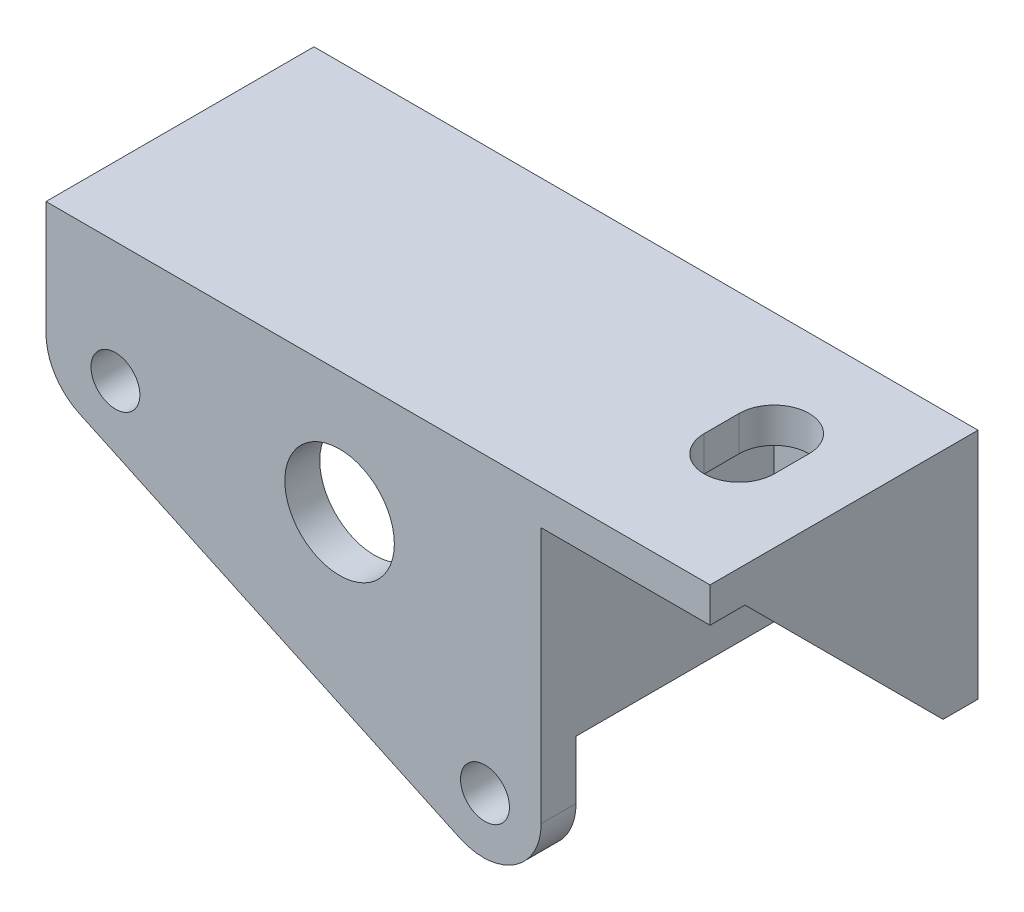
ISO-10303-21;
HEADER;
FILE_DESCRIPTION(('STEP AP214'),'2;1');
FILE_NAME('part.step','',(''),(''),'','','');
FILE_SCHEMA(('AUTOMOTIVE_DESIGN { 1 0 10303 214 1 1 1 1 }'));
ENDSEC;
DATA;
#1=APPLICATION_CONTEXT('core data for automotive mechanical design processes');
#2=APPLICATION_PROTOCOL_DEFINITION('international standard','automotive_design',2000,#1);
#3=PRODUCT_CONTEXT('',#1,'mechanical');
#4=PRODUCT('Part','Part','',(#3));
#5=PRODUCT_RELATED_PRODUCT_CATEGORY('part','',(#4));
#6=PRODUCT_DEFINITION_FORMATION('','',#4);
#7=PRODUCT_DEFINITION_CONTEXT('part definition',#1,'design');
#8=PRODUCT_DEFINITION('design','',#6,#7);
#9=PRODUCT_DEFINITION_SHAPE('','',#8);
#10=(LENGTH_UNIT() NAMED_UNIT(*) SI_UNIT(.MILLI.,.METRE.));
#11=(NAMED_UNIT(*) PLANE_ANGLE_UNIT() SI_UNIT($,.RADIAN.));
#12=(NAMED_UNIT(*) SI_UNIT($,.STERADIAN.) SOLID_ANGLE_UNIT());
#13=UNCERTAINTY_MEASURE_WITH_UNIT(LENGTH_MEASURE(1.E-05),#10,'distance_accuracy_value','');
#14=(GEOMETRIC_REPRESENTATION_CONTEXT(3) GLOBAL_UNCERTAINTY_ASSIGNED_CONTEXT((#13)) GLOBAL_UNIT_ASSIGNED_CONTEXT((#10,
#11,#12)) REPRESENTATION_CONTEXT('',''));
#15=CARTESIAN_POINT('',(0.,0.,0.));
#16=DIRECTION('',(0.,0.,1.));
#17=DIRECTION('',(1.,0.,0.));
#18=AXIS2_PLACEMENT_3D('',#15,#16,#17);
#19=CARTESIAN_POINT('',(-48.5,0.,20.));
#20=DIRECTION('',(0.,0.,-1.));
#21=DIRECTION('',(-1.,0.,0.));
#22=AXIS2_PLACEMENT_3D('',#19,#20,#21);
#23=PLANE('',#22);
#24=CARTESIAN_POINT('',(-42.5413323663169,-10.3546427164349,20.));
#25=DIRECTION('',(0.,0.,-1.));
#26=DIRECTION('',(-1.,0.,0.));
#27=AXIS2_PLACEMENT_3D('',#24,#25,#26);
#28=CIRCLE('',#27,2.09999999945802);
#29=CARTESIAN_POINT('',(-44.6413323657749,-10.3546427164349,20.));
#30=VERTEX_POINT('',#29);
#31=EDGE_CURVE('E387',#30,#30,#28,.T.);
#32=ORIENTED_EDGE('',*,*,#31,.F.);
#33=EDGE_LOOP('',(#32));
#34=FACE_BOUND('',#33,.T.);
#35=CARTESIAN_POINT('',(-10.8205598200341,-25.1462818773592,20.));
#36=DIRECTION('',(0.,0.,-1.));
#37=DIRECTION('',(-1.,0.,0.));
#38=AXIS2_PLACEMENT_3D('',#35,#36,#37);
#39=CIRCLE('',#38,2.09999999945802);
#40=CARTESIAN_POINT('',(-12.9205598194921,-25.1462818773592,20.));
#41=VERTEX_POINT('',#40);
#42=EDGE_CURVE('E390',#41,#41,#39,.T.);
#43=ORIENTED_EDGE('',*,*,#42,.F.);
#44=EDGE_LOOP('',(#43));
#45=FACE_BOUND('',#44,.T.);
#46=CARTESIAN_POINT('',(-23.3000000000015,-10.4999999999994,20.));
#47=DIRECTION('',(0.,0.,-1.));
#48=DIRECTION('',(-1.,0.,0.));
#49=AXIS2_PLACEMENT_3D('',#46,#47,#48);
#50=CIRCLE('',#49,4.7);
#51=CARTESIAN_POINT('',(-28.0000000000015,-10.4999999999994,20.));
#52=VERTEX_POINT('',#51);
#53=EDGE_CURVE('E395',#52,#52,#50,.T.);
#54=ORIENTED_EDGE('',*,*,#53,.F.);
#55=EDGE_LOOP('',(#54));
#56=FACE_BOUND('',#55,.T.);
#57=CARTESIAN_POINT('',(-11.,-25.,20.));
#58=DIRECTION('',(0.,0.,-1.));
#59=DIRECTION('',(-1.,0.,0.));
#60=AXIS2_PLACEMENT_3D('',#57,#58,#59);
#61=CIRCLE('',#60,5.);
#62=CARTESIAN_POINT('',(-6.,-25.,20.));
#63=VERTEX_POINT('',#62);
#64=CARTESIAN_POINT('',(-10.9674545190611,-29.9998940780451,20.));
#65=VERTEX_POINT('',#64);
#66=EDGE_CURVE('E51',#63,#65,#61,.T.);
#67=ORIENTED_EDGE('',*,*,#66,.T.);
#68=CARTESIAN_POINT('',(-10.9349090381221,-25.,20.));
#69=DIRECTION('',(0.,0.,-1.));
#70=DIRECTION('',(-1.,0.,0.));
#71=AXIS2_PLACEMENT_3D('',#68,#69,#70);
#72=CIRCLE('',#71,5.);
#73=CARTESIAN_POINT('',(-13.0480003468256,-29.5315389351833,20.));
#74=VERTEX_POINT('',#73);
#75=EDGE_CURVE('E367',#65,#74,#72,.T.);
#76=ORIENTED_EDGE('',*,*,#75,.T.);
#77=DIRECTION('',(0.906307787036653,-0.422618261740693,0.));
#78=VECTOR('',#77,1.);
#79=CARTESIAN_POINT('',(-53.4792888802733,-10.6781194629626,20.));
#80=LINE('',#79,#78);
#81=CARTESIAN_POINT('',(-45.6130913087035,-14.3461876311458,20.));
#82=VERTEX_POINT('',#81);
#83=EDGE_CURVE('E372',#82,#74,#80,.T.);
#84=ORIENTED_EDGE('',*,*,#83,.F.);
#85=CARTESIAN_POINT('',(-43.5,-9.81464869596251,20.));
#86=DIRECTION('',(0.,0.,-1.));
#87=DIRECTION('',(-1.,0.,0.));
#88=AXIS2_PLACEMENT_3D('',#85,#86,#87);
#89=CIRCLE('',#88,5.);
#90=CARTESIAN_POINT('',(-48.5,-9.81464869596251,20.));
#91=VERTEX_POINT('',#90);
#92=EDGE_CURVE('E364',#82,#91,#89,.T.);
#93=ORIENTED_EDGE('',*,*,#92,.T.);
#94=DIRECTION('',(0.,1.,0.));
#95=VECTOR('',#94,1.);
#96=CARTESIAN_POINT('',(-48.5,0.,20.));
#97=LINE('',#96,#95);
#98=CARTESIAN_POINT('',(-48.5,-3.,20.));
#99=VERTEX_POINT('',#98);
#100=EDGE_CURVE('E226',#91,#99,#97,.T.);
#101=ORIENTED_EDGE('',*,*,#100,.T.);
#102=DIRECTION('',(1.,0.,0.));
#103=VECTOR('',#102,1.);
#104=CARTESIAN_POINT('',(-48.5,-3.,20.));
#105=LINE('',#104,#103);
#106=CARTESIAN_POINT('',(-8.5,-3.,20.));
#107=VERTEX_POINT('',#106);
#108=EDGE_CURVE('E244',#99,#107,#105,.T.);
#109=ORIENTED_EDGE('',*,*,#108,.T.);
#110=DIRECTION('',(0.,1.,0.));
#111=VECTOR('',#110,1.);
#112=CARTESIAN_POINT('',(-8.5,-3.,20.));
#113=LINE('',#112,#111);
#114=CARTESIAN_POINT('',(-8.5,-20.,20.));
#115=VERTEX_POINT('',#114);
#116=EDGE_CURVE('E206',#115,#107,#113,.T.);
#117=ORIENTED_EDGE('',*,*,#116,.F.);
#118=DIRECTION('',(-1.,0.,0.));
#119=VECTOR('',#118,1.);
#120=CARTESIAN_POINT('',(-8.5,-20.,20.));
#121=LINE('',#120,#119);
#122=CARTESIAN_POINT('',(-6.,-20.,20.));
#123=VERTEX_POINT('',#122);
#124=EDGE_CURVE('E223',#123,#115,#121,.T.);
#125=ORIENTED_EDGE('',*,*,#124,.F.);
#126=DIRECTION('',(0.,1.,0.));
#127=VECTOR('',#126,1.);
#128=CARTESIAN_POINT('',(-6.,-3.,20.));
#129=LINE('',#128,#127);
#130=EDGE_CURVE('E216',#63,#123,#129,.T.);
#131=ORIENTED_EDGE('',*,*,#130,.F.);
#132=EDGE_LOOP('',(#67,#76,#84,#93,#101,#109,#117,#125,#131));
#133=FACE_BOUND('',#132,.T.);
#134=ADVANCED_FACE('F35',(#34,#45,#56,#133),#23,.T.);
#135=CARTESIAN_POINT('',(8.5,0.,0.));
#136=DIRECTION('',(0.,-1.,0.));
#137=DIRECTION('',(0.,0.,-1.));
#138=AXIS2_PLACEMENT_3D('',#135,#136,#137);
#139=PLANE('',#138);
#140=DIRECTION('',(-1.,0.,0.));
#141=VECTOR('',#140,1.);
#142=CARTESIAN_POINT('',(8.5,0.,0.));
#143=LINE('',#142,#141);
#144=CARTESIAN_POINT('',(8.5,0.,0.));
#145=VERTEX_POINT('',#144);
#146=CARTESIAN_POINT('',(-48.5,0.,0.));
#147=VERTEX_POINT('',#146);
#148=EDGE_CURVE('E349',#145,#147,#143,.T.);
#149=ORIENTED_EDGE('',*,*,#148,.T.);
#150=DIRECTION('',(0.,0.,-1.));
#151=VECTOR('',#150,1.);
#152=CARTESIAN_POINT('',(-48.5,0.,20.));
#153=LINE('',#152,#151);
#154=CARTESIAN_POINT('',(-48.5,0.,23.));
#155=VERTEX_POINT('',#154);
#156=EDGE_CURVE('E236',#155,#147,#153,.T.);
#157=ORIENTED_EDGE('',*,*,#156,.F.);
#158=DIRECTION('',(1.,0.,0.));
#159=VECTOR('',#158,1.);
#160=CARTESIAN_POINT('',(-48.5,0.,23.));
#161=LINE('',#160,#159);
#162=CARTESIAN_POINT('',(8.5,0.,23.));
#163=VERTEX_POINT('',#162);
#164=EDGE_CURVE('E233',#155,#163,#161,.T.);
#165=ORIENTED_EDGE('',*,*,#164,.T.);
#166=DIRECTION('',(0.,0.,1.));
#167=VECTOR('',#166,1.);
#168=CARTESIAN_POINT('',(8.5,0.,0.));
#169=LINE('',#168,#167);
#170=EDGE_CURVE('E220',#145,#163,#169,.T.);
#171=ORIENTED_EDGE('',*,*,#170,.F.);
#172=EDGE_LOOP('',(#149,#157,#165,#171));
#173=FACE_BOUND('',#172,.T.);
#174=CARTESIAN_POINT('',(0.,0.,9.00000000000001));
#175=DIRECTION('',(0.,-1.,0.));
#176=DIRECTION('',(0.,0.,-1.));
#177=AXIS2_PLACEMENT_3D('',#174,#175,#176);
#178=CIRCLE('',#177,3.);
#179=CARTESIAN_POINT('',(-3.,0.,9.));
#180=VERTEX_POINT('',#179);
#181=CARTESIAN_POINT('',(3.,0.,9.));
#182=VERTEX_POINT('',#181);
#183=EDGE_CURVE('E258',#180,#182,#178,.T.);
#184=ORIENTED_EDGE('',*,*,#183,.T.);
#185=DIRECTION('',(0.,0.,1.));
#186=VECTOR('',#185,1.);
#187=CARTESIAN_POINT('',(3.,0.,9.00000000000001));
#188=LINE('',#187,#186);
#189=CARTESIAN_POINT('',(3.,0.,12.));
#190=VERTEX_POINT('',#189);
#191=EDGE_CURVE('E276',#182,#190,#188,.T.);
#192=ORIENTED_EDGE('',*,*,#191,.T.);
#193=CARTESIAN_POINT('',(0.,0.,12.));
#194=DIRECTION('',(0.,-1.,0.));
#195=DIRECTION('',(0.,0.,-1.));
#196=AXIS2_PLACEMENT_3D('',#193,#194,#195);
#197=CIRCLE('',#196,3.);
#198=CARTESIAN_POINT('',(-3.,0.,12.));
#199=VERTEX_POINT('',#198);
#200=EDGE_CURVE('E252',#190,#199,#197,.T.);
#201=ORIENTED_EDGE('',*,*,#200,.T.);
#202=DIRECTION('',(0.,0.,-1.));
#203=VECTOR('',#202,1.);
#204=CARTESIAN_POINT('',(-3.,0.,9.00000000000001));
#205=LINE('',#204,#203);
#206=EDGE_CURVE('E255',#199,#180,#205,.T.);
#207=ORIENTED_EDGE('',*,*,#206,.T.);
#208=EDGE_LOOP('',(#184,#192,#201,#207));
#209=FACE_BOUND('',#208,.T.);
#210=ADVANCED_FACE('F443',(#173,#209),#139,.F.);
#211=CARTESIAN_POINT('',(-6.,-3.,2.99999999999999));
#212=DIRECTION('',(0.,1.,0.));
#213=DIRECTION('',(0.,0.,1.));
#214=AXIS2_PLACEMENT_3D('',#211,#212,#213);
#215=PLANE('',#214);
#216=DIRECTION('',(0.,0.,1.));
#217=VECTOR('',#216,1.);
#218=CARTESIAN_POINT('',(6.,-3.,2.99999999999999));
#219=LINE('',#218,#217);
#220=CARTESIAN_POINT('',(6.,-3.,2.99999999999999));
#221=VERTEX_POINT('',#220);
#222=CARTESIAN_POINT('',(6.,-3.,20.));
#223=VERTEX_POINT('',#222);
#224=EDGE_CURVE('E321',#221,#223,#219,.T.);
#225=ORIENTED_EDGE('',*,*,#224,.T.);
#226=DIRECTION('',(-1.,0.,0.));
#227=VECTOR('',#226,1.);
#228=CARTESIAN_POINT('',(8.5,-3.,20.));
#229=LINE('',#228,#227);
#230=CARTESIAN_POINT('',(8.5,-3.,20.));
#231=VERTEX_POINT('',#230);
#232=EDGE_CURVE('E202',#231,#223,#229,.T.);
#233=ORIENTED_EDGE('',*,*,#232,.F.);
#234=DIRECTION('',(0.,0.,-1.));
#235=VECTOR('',#234,1.);
#236=CARTESIAN_POINT('',(8.5,-3.,23.));
#237=LINE('',#236,#235);
#238=CARTESIAN_POINT('',(8.5,-3.,23.));
#239=VERTEX_POINT('',#238);
#240=EDGE_CURVE('E194',#239,#231,#237,.T.);
#241=ORIENTED_EDGE('',*,*,#240,.F.);
#242=DIRECTION('',(1.,0.,0.));
#243=VECTOR('',#242,1.);
#244=CARTESIAN_POINT('',(8.5,-3.,23.));
#245=LINE('',#244,#243);
#246=CARTESIAN_POINT('',(-6.,-3.,23.));
#247=VERTEX_POINT('',#246);
#248=EDGE_CURVE('E200',#247,#239,#245,.T.);
#249=ORIENTED_EDGE('',*,*,#248,.F.);
#250=DIRECTION('',(0.,0.,1.));
#251=VECTOR('',#250,1.);
#252=CARTESIAN_POINT('',(-6.,-3.,2.99999999999999));
#253=LINE('',#252,#251);
#254=CARTESIAN_POINT('',(-6.,-3.,2.99999999999999));
#255=VERTEX_POINT('',#254);
#256=EDGE_CURVE('E320',#255,#247,#253,.T.);
#257=ORIENTED_EDGE('',*,*,#256,.F.);
#258=DIRECTION('',(1.,0.,0.));
#259=VECTOR('',#258,1.);
#260=CARTESIAN_POINT('',(-6.,-3.,2.99999999999999));
#261=LINE('',#260,#259);
#262=EDGE_CURVE('E323',#255,#221,#261,.T.);
#263=ORIENTED_EDGE('',*,*,#262,.T.);
#264=EDGE_LOOP('',(#225,#233,#241,#249,#257,#263));
#265=FACE_BOUND('',#264,.T.);
#266=CARTESIAN_POINT('',(0.,-3.,9.));
#267=DIRECTION('',(0.,1.,0.));
#268=DIRECTION('',(-1.,0.,0.));
#269=AXIS2_PLACEMENT_3D('',#266,#267,#268);
#270=CIRCLE('',#269,3.);
#271=CARTESIAN_POINT('',(3.,-3.,9.));
#272=VERTEX_POINT('',#271);
#273=CARTESIAN_POINT('',(-3.,-3.,9.));
#274=VERTEX_POINT('',#273);
#275=EDGE_CURVE('E261',#272,#274,#270,.T.);
#276=ORIENTED_EDGE('',*,*,#275,.T.);
#277=DIRECTION('',(0.,0.,1.));
#278=VECTOR('',#277,1.);
#279=CARTESIAN_POINT('',(-3.,-3.,9.));
#280=LINE('',#279,#278);
#281=CARTESIAN_POINT('',(-3.,-3.,12.));
#282=VERTEX_POINT('',#281);
#283=EDGE_CURVE('E270',#274,#282,#280,.T.);
#284=ORIENTED_EDGE('',*,*,#283,.T.);
#285=CARTESIAN_POINT('',(0.,-3.,12.));
#286=DIRECTION('',(0.,1.,0.));
#287=DIRECTION('',(1.,0.,0.));
#288=AXIS2_PLACEMENT_3D('',#285,#286,#287);
#289=CIRCLE('',#288,3.);
#290=CARTESIAN_POINT('',(3.,-3.,12.));
#291=VERTEX_POINT('',#290);
#292=EDGE_CURVE('E267',#282,#291,#289,.T.);
#293=ORIENTED_EDGE('',*,*,#292,.T.);
#294=DIRECTION('',(0.,0.,-1.));
#295=VECTOR('',#294,1.);
#296=CARTESIAN_POINT('',(3.,-3.,9.));
#297=LINE('',#296,#295);
#298=EDGE_CURVE('E264',#291,#272,#297,.T.);
#299=ORIENTED_EDGE('',*,*,#298,.T.);
#300=EDGE_LOOP('',(#276,#284,#293,#299));
#301=FACE_BOUND('',#300,.T.);
#302=ADVANCED_FACE('F197',(#265,#301),#215,.F.);
#303=CARTESIAN_POINT('',(8.5,-20.,2.99999999999999));
#304=DIRECTION('',(0.,0.707106781186548,-0.707106781186547));
#305=DIRECTION('',(0.,0.707106781186547,0.707106781186548));
#306=AXIS2_PLACEMENT_3D('',#303,#304,#305);
#307=PLANE('',#306);
#308=DIRECTION('',(0.,0.707106781186547,0.707106781186548));
#309=VECTOR('',#308,1.);
#310=CARTESIAN_POINT('',(6.,-20.,2.99999999999999));
#311=LINE('',#310,#309);
#312=CARTESIAN_POINT('',(6.,-20.,2.99999999999999));
#313=VERTEX_POINT('',#312);
#314=EDGE_CURVE('E351',#313,#223,#311,.T.);
#315=ORIENTED_EDGE('',*,*,#314,.F.);
#316=DIRECTION('',(-1.,0.,0.));
#317=VECTOR('',#316,1.);
#318=CARTESIAN_POINT('',(8.5,-20.,2.99999999999999));
#319=LINE('',#318,#317);
#320=CARTESIAN_POINT('',(8.5,-20.,2.99999999999999));
#321=VERTEX_POINT('',#320);
#322=EDGE_CURVE('E345',#321,#313,#319,.T.);
#323=ORIENTED_EDGE('',*,*,#322,.F.);
#324=DIRECTION('',(0.,-0.707106781186548,-0.707106781186548));
#325=VECTOR('',#324,1.);
#326=CARTESIAN_POINT('',(8.5,-3.,20.));
#327=LINE('',#326,#325);
#328=EDGE_CURVE('E335',#231,#321,#327,.T.);
#329=ORIENTED_EDGE('',*,*,#328,.F.);
#330=ORIENTED_EDGE('',*,*,#232,.T.);
#331=EDGE_LOOP('',(#315,#323,#329,#330));
#332=FACE_BOUND('',#331,.T.);
#333=ADVANCED_FACE('F424',(#332),#307,.F.);
#334=CARTESIAN_POINT('',(8.5,0.,0.));
#335=DIRECTION('',(0.,0.,1.));
#336=DIRECTION('',(0.,-1.,0.));
#337=AXIS2_PLACEMENT_3D('',#334,#335,#336);
#338=PLANE('',#337);
#339=DIRECTION('',(0.,-1.,0.));
#340=VECTOR('',#339,1.);
#341=CARTESIAN_POINT('',(3.,-9.00000000000001,0.));
#342=LINE('',#341,#340);
#343=CARTESIAN_POINT('',(3.,-9.00000000000001,0.));
#344=VERTEX_POINT('',#343);
#345=CARTESIAN_POINT('',(3.,-12.,0.));
#346=VERTEX_POINT('',#345);
#347=EDGE_CURVE('E287',#344,#346,#342,.T.);
#348=ORIENTED_EDGE('',*,*,#347,.F.);
#349=CARTESIAN_POINT('',(0.,-9.00000000000001,0.));
#350=DIRECTION('',(0.,0.,1.));
#351=DIRECTION('',(0.,-1.,0.));
#352=AXIS2_PLACEMENT_3D('',#349,#350,#351);
#353=CIRCLE('',#352,3.);
#354=CARTESIAN_POINT('',(-3.,-9.00000000000001,0.));
#355=VERTEX_POINT('',#354);
#356=EDGE_CURVE('E290',#355,#344,#353,.F.);
#357=ORIENTED_EDGE('',*,*,#356,.F.);
#358=DIRECTION('',(0.,1.,0.));
#359=VECTOR('',#358,1.);
#360=CARTESIAN_POINT('',(-3.,-9.00000000000001,0.));
#361=LINE('',#360,#359);
#362=CARTESIAN_POINT('',(-3.,-12.,0.));
#363=VERTEX_POINT('',#362);
#364=EDGE_CURVE('E307',#363,#355,#361,.T.);
#365=ORIENTED_EDGE('',*,*,#364,.F.);
#366=CARTESIAN_POINT('',(0.,-12.,0.));
#367=DIRECTION('',(0.,0.,1.));
#368=DIRECTION('',(0.,-1.,0.));
#369=AXIS2_PLACEMENT_3D('',#366,#367,#368);
#370=CIRCLE('',#369,3.);
#371=EDGE_CURVE('E285',#346,#363,#370,.F.);
#372=ORIENTED_EDGE('',*,*,#371,.F.);
#373=EDGE_LOOP('',(#348,#357,#365,#372));
#374=FACE_BOUND('',#373,.T.);
#375=DIRECTION('',(0.,1.,0.));
#376=VECTOR('',#375,1.);
#377=CARTESIAN_POINT('',(-8.5,0.,0.));
#378=LINE('',#377,#376);
#379=CARTESIAN_POINT('',(-8.5,-20.,0.));
#380=VERTEX_POINT('',#379);
#381=CARTESIAN_POINT('',(-8.5,-3.,0.));
#382=VERTEX_POINT('',#381);
#383=EDGE_CURVE('E329',#380,#382,#378,.T.);
#384=ORIENTED_EDGE('',*,*,#383,.T.);
#385=DIRECTION('',(1.,0.,0.));
#386=VECTOR('',#385,1.);
#387=CARTESIAN_POINT('',(-48.5,-3.,0.));
#388=LINE('',#387,#386);
#389=CARTESIAN_POINT('',(-48.5,-3.,0.));
#390=VERTEX_POINT('',#389);
#391=EDGE_CURVE('E249',#390,#382,#388,.T.);
#392=ORIENTED_EDGE('',*,*,#391,.F.);
#393=DIRECTION('',(0.,-1.,0.));
#394=VECTOR('',#393,1.);
#395=CARTESIAN_POINT('',(-48.5,0.,0.));
#396=LINE('',#395,#394);
#397=EDGE_CURVE('E239',#147,#390,#396,.T.);
#398=ORIENTED_EDGE('',*,*,#397,.F.);
#399=ORIENTED_EDGE('',*,*,#148,.F.);
#400=DIRECTION('',(0.,1.,0.));
#401=VECTOR('',#400,1.);
#402=CARTESIAN_POINT('',(8.5,0.,0.));
#403=LINE('',#402,#401);
#404=CARTESIAN_POINT('',(8.5,-20.,0.));
#405=VERTEX_POINT('',#404);
#406=EDGE_CURVE('E331',#405,#145,#403,.T.);
#407=ORIENTED_EDGE('',*,*,#406,.F.);
#408=DIRECTION('',(-1.,0.,0.));
#409=VECTOR('',#408,1.);
#410=CARTESIAN_POINT('',(8.5,-20.,0.));
#411=LINE('',#410,#409);
#412=EDGE_CURVE('E339',#405,#380,#411,.T.);
#413=ORIENTED_EDGE('',*,*,#412,.T.);
#414=EDGE_LOOP('',(#384,#392,#398,#399,#407,#413));
#415=FACE_BOUND('',#414,.T.);
#416=ADVANCED_FACE('F417',(#374,#415),#338,.F.);
#417=CARTESIAN_POINT('',(8.5,-20.,0.));
#418=DIRECTION('',(0.,1.,0.));
#419=DIRECTION('',(0.,0.,1.));
#420=AXIS2_PLACEMENT_3D('',#417,#418,#419);
#421=PLANE('',#420);
#422=DIRECTION('',(0.,0.,-1.));
#423=VECTOR('',#422,1.);
#424=CARTESIAN_POINT('',(-8.5,-20.,0.));
#425=LINE('',#424,#423);
#426=EDGE_CURVE('E333',#115,#380,#425,.T.);
#427=ORIENTED_EDGE('',*,*,#426,.T.);
#428=ORIENTED_EDGE('',*,*,#412,.F.);
#429=DIRECTION('',(0.,0.,-1.));
#430=VECTOR('',#429,1.);
#431=CARTESIAN_POINT('',(8.5,-20.,0.));
#432=LINE('',#431,#430);
#433=EDGE_CURVE('E337',#321,#405,#432,.T.);
#434=ORIENTED_EDGE('',*,*,#433,.F.);
#435=ORIENTED_EDGE('',*,*,#322,.T.);
#436=DIRECTION('',(1.,0.,0.));
#437=VECTOR('',#436,1.);
#438=CARTESIAN_POINT('',(-6.,-20.,2.99999999999999));
#439=LINE('',#438,#437);
#440=CARTESIAN_POINT('',(-6.,-20.,2.99999999999999));
#441=VERTEX_POINT('',#440);
#442=EDGE_CURVE('E327',#441,#313,#439,.T.);
#443=ORIENTED_EDGE('',*,*,#442,.F.);
#444=DIRECTION('',(0.,0.,1.));
#445=VECTOR('',#444,1.);
#446=CARTESIAN_POINT('',(-6.,-20.,-9.24152301894267));
#447=LINE('',#446,#445);
#448=EDGE_CURVE('E229',#441,#123,#447,.T.);
#449=ORIENTED_EDGE('',*,*,#448,.T.);
#450=ORIENTED_EDGE('',*,*,#124,.T.);
#451=EDGE_LOOP('',(#427,#428,#434,#435,#443,#449,#450));
#452=FACE_BOUND('',#451,.T.);
#453=ADVANCED_FACE('F406',(#452),#421,.F.);
#454=CARTESIAN_POINT('',(8.5,0.,0.));
#455=DIRECTION('',(-1.,0.,0.));
#456=DIRECTION('',(0.,0.,1.));
#457=AXIS2_PLACEMENT_3D('',#454,#455,#456);
#458=PLANE('',#457);
#459=DIRECTION('',(0.,-1.,0.));
#460=VECTOR('',#459,1.);
#461=CARTESIAN_POINT('',(8.5,-30.,23.));
#462=LINE('',#461,#460);
#463=EDGE_CURVE('E214',#163,#239,#462,.T.);
#464=ORIENTED_EDGE('',*,*,#463,.T.);
#465=ORIENTED_EDGE('',*,*,#240,.T.);
#466=ORIENTED_EDGE('',*,*,#328,.T.);
#467=ORIENTED_EDGE('',*,*,#433,.T.);
#468=ORIENTED_EDGE('',*,*,#406,.T.);
#469=ORIENTED_EDGE('',*,*,#170,.T.);
#470=EDGE_LOOP('',(#464,#465,#466,#467,#468,#469));
#471=FACE_BOUND('',#470,.T.);
#472=ADVANCED_FACE('F218',(#471),#458,.F.);
#473=CARTESIAN_POINT('',(-8.5,0.,0.));
#474=DIRECTION('',(-1.,0.,0.));
#475=DIRECTION('',(0.,0.,1.));
#476=AXIS2_PLACEMENT_3D('',#473,#474,#475);
#477=PLANE('',#476);
#478=DIRECTION('',(0.,0.,1.));
#479=VECTOR('',#478,1.);
#480=CARTESIAN_POINT('',(-8.5,-3.,0.));
#481=LINE('',#480,#479);
#482=EDGE_CURVE('E235',#382,#107,#481,.T.);
#483=ORIENTED_EDGE('',*,*,#482,.F.);
#484=ORIENTED_EDGE('',*,*,#383,.F.);
#485=ORIENTED_EDGE('',*,*,#426,.F.);
#486=ORIENTED_EDGE('',*,*,#116,.T.);
#487=EDGE_LOOP('',(#483,#484,#485,#486));
#488=FACE_BOUND('',#487,.T.);
#489=ADVANCED_FACE('F411',(#488),#477,.T.);
#490=CARTESIAN_POINT('',(-6.,0.,0.));
#491=DIRECTION('',(-1.,0.,0.));
#492=DIRECTION('',(0.,0.,1.));
#493=AXIS2_PLACEMENT_3D('',#490,#491,#492);
#494=PLANE('',#493);
#495=DIRECTION('',(0.,1.,0.));
#496=VECTOR('',#495,1.);
#497=CARTESIAN_POINT('',(-6.,-3.,23.));
#498=LINE('',#497,#496);
#499=CARTESIAN_POINT('',(-6.,-25.,23.));
#500=VERTEX_POINT('',#499);
#501=EDGE_CURVE('E207',#500,#247,#498,.T.);
#502=ORIENTED_EDGE('',*,*,#501,.F.);
#503=DIRECTION('',(0.,0.,-1.));
#504=VECTOR('',#503,1.);
#505=CARTESIAN_POINT('',(-6.,-25.,20.));
#506=LINE('',#505,#504);
#507=EDGE_CURVE('E44',#500,#63,#506,.T.);
#508=ORIENTED_EDGE('',*,*,#507,.T.);
#509=ORIENTED_EDGE('',*,*,#130,.T.);
#510=ORIENTED_EDGE('',*,*,#448,.F.);
#511=DIRECTION('',(0.,1.,0.));
#512=VECTOR('',#511,1.);
#513=CARTESIAN_POINT('',(-6.,-3.,2.99999999999999));
#514=LINE('',#513,#512);
#515=EDGE_CURVE('E317',#441,#255,#514,.T.);
#516=ORIENTED_EDGE('',*,*,#515,.T.);
#517=ORIENTED_EDGE('',*,*,#256,.T.);
#518=EDGE_LOOP('',(#502,#508,#509,#510,#516,#517));
#519=FACE_BOUND('',#518,.T.);
#520=ADVANCED_FACE('F431',(#519),#494,.F.);
#521=CARTESIAN_POINT('',(6.,0.,0.));
#522=DIRECTION('',(-1.,0.,0.));
#523=DIRECTION('',(0.,0.,1.));
#524=AXIS2_PLACEMENT_3D('',#521,#522,#523);
#525=PLANE('',#524);
#526=ORIENTED_EDGE('',*,*,#314,.T.);
#527=ORIENTED_EDGE('',*,*,#224,.F.);
#528=DIRECTION('',(0.,1.,0.));
#529=VECTOR('',#528,1.);
#530=CARTESIAN_POINT('',(6.,-3.,2.99999999999999));
#531=LINE('',#530,#529);
#532=EDGE_CURVE('E316',#313,#221,#531,.T.);
#533=ORIENTED_EDGE('',*,*,#532,.F.);
#534=EDGE_LOOP('',(#526,#527,#533));
#535=FACE_BOUND('',#534,.T.);
#536=ADVANCED_FACE('F428',(#535),#525,.T.);
#537=CARTESIAN_POINT('',(-6.,-3.,2.99999999999999));
#538=DIRECTION('',(0.,0.,-1.));
#539=DIRECTION('',(0.,1.,0.));
#540=AXIS2_PLACEMENT_3D('',#537,#538,#539);
#541=PLANE('',#540);
#542=DIRECTION('',(0.,-1.,0.));
#543=VECTOR('',#542,1.);
#544=CARTESIAN_POINT('',(-3.,-9.00000000000001,2.99999999999999));
#545=LINE('',#544,#543);
#546=CARTESIAN_POINT('',(-3.,-9.00000000000001,2.99999999999999));
#547=VERTEX_POINT('',#546);
#548=CARTESIAN_POINT('',(-3.,-12.,2.99999999999999));
#549=VERTEX_POINT('',#548);
#550=EDGE_CURVE('E295',#547,#549,#545,.T.);
#551=ORIENTED_EDGE('',*,*,#550,.F.);
#552=CARTESIAN_POINT('',(0.,-9.00000000000001,2.99999999999999));
#553=DIRECTION('',(0.,0.,1.));
#554=DIRECTION('',(-1.,0.,0.));
#555=AXIS2_PLACEMENT_3D('',#552,#553,#554);
#556=CIRCLE('',#555,3.);
#557=CARTESIAN_POINT('',(3.,-9.00000000000001,2.99999999999999));
#558=VERTEX_POINT('',#557);
#559=EDGE_CURVE('E293',#558,#547,#556,.T.);
#560=ORIENTED_EDGE('',*,*,#559,.F.);
#561=DIRECTION('',(0.,1.,0.));
#562=VECTOR('',#561,1.);
#563=CARTESIAN_POINT('',(3.,-9.00000000000001,2.99999999999999));
#564=LINE('',#563,#562);
#565=CARTESIAN_POINT('',(3.,-12.,2.99999999999999));
#566=VERTEX_POINT('',#565);
#567=EDGE_CURVE('E301',#566,#558,#564,.T.);
#568=ORIENTED_EDGE('',*,*,#567,.F.);
#569=CARTESIAN_POINT('',(0.,-12.,2.99999999999999));
#570=DIRECTION('',(0.,0.,1.));
#571=DIRECTION('',(1.,0.,0.));
#572=AXIS2_PLACEMENT_3D('',#569,#570,#571);
#573=CIRCLE('',#572,3.);
#574=EDGE_CURVE('E298',#549,#566,#573,.T.);
#575=ORIENTED_EDGE('',*,*,#574,.F.);
#576=EDGE_LOOP('',(#551,#560,#568,#575));
#577=FACE_BOUND('',#576,.T.);
#578=ORIENTED_EDGE('',*,*,#532,.T.);
#579=ORIENTED_EDGE('',*,*,#262,.F.);
#580=ORIENTED_EDGE('',*,*,#515,.F.);
#581=ORIENTED_EDGE('',*,*,#442,.T.);
#582=EDGE_LOOP('',(#578,#579,#580,#581));
#583=FACE_BOUND('',#582,.T.);
#584=ADVANCED_FACE('F430',(#577,#583),#541,.F.);
#585=CARTESIAN_POINT('',(0.,-9.00000000000001,-0.00100000000001401));
#586=DIRECTION('',(0.,0.,1.));
#587=DIRECTION('',(1.,0.,0.));
#588=AXIS2_PLACEMENT_3D('',#585,#586,#587);
#589=CYLINDRICAL_SURFACE('',#588,3.);
#590=ORIENTED_EDGE('',*,*,#356,.T.);
#591=DIRECTION('',(0.,0.,1.));
#592=VECTOR('',#591,1.);
#593=CARTESIAN_POINT('',(3.,-9.00000000000001,-0.00100000000001401));
#594=LINE('',#593,#592);
#595=EDGE_CURVE('E305',#344,#558,#594,.T.);
#596=ORIENTED_EDGE('',*,*,#595,.T.);
#597=ORIENTED_EDGE('',*,*,#559,.T.);
#598=DIRECTION('',(0.,0.,1.));
#599=VECTOR('',#598,1.);
#600=CARTESIAN_POINT('',(-3.,-9.00000000000001,-0.00100000000001401));
#601=LINE('',#600,#599);
#602=EDGE_CURVE('E304',#355,#547,#601,.T.);
#603=ORIENTED_EDGE('',*,*,#602,.F.);
#604=EDGE_LOOP('',(#590,#596,#597,#603));
#605=FACE_BOUND('',#604,.T.);
#606=ADVANCED_FACE('F487',(#605),#589,.F.);
#607=CARTESIAN_POINT('',(3.,-9.00000000000001,-0.00100000000001401));
#608=DIRECTION('',(1.,0.,0.));
#609=DIRECTION('',(0.,1.,0.));
#610=AXIS2_PLACEMENT_3D('',#607,#608,#609);
#611=PLANE('',#610);
#612=ORIENTED_EDGE('',*,*,#347,.T.);
#613=DIRECTION('',(0.,0.,1.));
#614=VECTOR('',#613,1.);
#615=CARTESIAN_POINT('',(3.,-12.,-0.00100000000001401));
#616=LINE('',#615,#614);
#617=EDGE_CURVE('E308',#346,#566,#616,.T.);
#618=ORIENTED_EDGE('',*,*,#617,.T.);
#619=ORIENTED_EDGE('',*,*,#567,.T.);
#620=ORIENTED_EDGE('',*,*,#595,.F.);
#621=EDGE_LOOP('',(#612,#618,#619,#620));
#622=FACE_BOUND('',#621,.T.);
#623=ADVANCED_FACE('F483',(#622),#611,.F.);
#624=CARTESIAN_POINT('',(0.,-12.,-0.00100000000001401));
#625=DIRECTION('',(0.,0.,1.));
#626=DIRECTION('',(1.,0.,0.));
#627=AXIS2_PLACEMENT_3D('',#624,#625,#626);
#628=CYLINDRICAL_SURFACE('',#627,3.);
#629=ORIENTED_EDGE('',*,*,#371,.T.);
#630=DIRECTION('',(0.,0.,1.));
#631=VECTOR('',#630,1.);
#632=CARTESIAN_POINT('',(-3.,-12.,-0.00100000000001401));
#633=LINE('',#632,#631);
#634=EDGE_CURVE('E310',#363,#549,#633,.T.);
#635=ORIENTED_EDGE('',*,*,#634,.T.);
#636=ORIENTED_EDGE('',*,*,#574,.T.);
#637=ORIENTED_EDGE('',*,*,#617,.F.);
#638=EDGE_LOOP('',(#629,#635,#636,#637));
#639=FACE_BOUND('',#638,.T.);
#640=ADVANCED_FACE('F486',(#639),#628,.F.);
#641=CARTESIAN_POINT('',(-3.,-9.00000000000001,-0.00100000000001401));
#642=DIRECTION('',(-1.,0.,0.));
#643=DIRECTION('',(0.,-1.,0.));
#644=AXIS2_PLACEMENT_3D('',#641,#642,#643);
#645=PLANE('',#644);
#646=ORIENTED_EDGE('',*,*,#364,.T.);
#647=ORIENTED_EDGE('',*,*,#602,.T.);
#648=ORIENTED_EDGE('',*,*,#550,.T.);
#649=ORIENTED_EDGE('',*,*,#634,.F.);
#650=EDGE_LOOP('',(#646,#647,#648,#649));
#651=FACE_BOUND('',#650,.T.);
#652=ADVANCED_FACE('F481',(#651),#645,.F.);
#653=CARTESIAN_POINT('',(0.,0.00100000000001488,9.00000000000001));
#654=DIRECTION('',(0.,-1.,0.));
#655=DIRECTION('',(0.,0.,-1.));
#656=AXIS2_PLACEMENT_3D('',#653,#654,#655);
#657=CYLINDRICAL_SURFACE('',#656,3.);
#658=DIRECTION('',(0.,-1.,0.));
#659=VECTOR('',#658,1.);
#660=CARTESIAN_POINT('',(-3.,0.00100000000001488,9.00000000000001));
#661=LINE('',#660,#659);
#662=EDGE_CURVE('E274',#180,#274,#661,.T.);
#663=ORIENTED_EDGE('',*,*,#662,.T.);
#664=ORIENTED_EDGE('',*,*,#275,.F.);
#665=DIRECTION('',(0.,-1.,0.));
#666=VECTOR('',#665,1.);
#667=CARTESIAN_POINT('',(3.,0.00100000000001488,9.00000000000001));
#668=LINE('',#667,#666);
#669=EDGE_CURVE('E273',#182,#272,#668,.T.);
#670=ORIENTED_EDGE('',*,*,#669,.F.);
#671=ORIENTED_EDGE('',*,*,#183,.F.);
#672=EDGE_LOOP('',(#663,#664,#670,#671));
#673=FACE_BOUND('',#672,.T.);
#674=ADVANCED_FACE('F471',(#673),#657,.F.);
#675=CARTESIAN_POINT('',(-3.,0.00100000000001488,9.00000000000001));
#676=DIRECTION('',(1.,0.,0.));
#677=DIRECTION('',(0.,0.,-1.));
#678=AXIS2_PLACEMENT_3D('',#675,#676,#677);
#679=PLANE('',#678);
#680=DIRECTION('',(0.,-1.,0.));
#681=VECTOR('',#680,1.);
#682=CARTESIAN_POINT('',(-3.,0.00100000000001141,12.));
#683=LINE('',#682,#681);
#684=EDGE_CURVE('E277',#199,#282,#683,.T.);
#685=ORIENTED_EDGE('',*,*,#684,.T.);
#686=ORIENTED_EDGE('',*,*,#283,.F.);
#687=ORIENTED_EDGE('',*,*,#662,.F.);
#688=ORIENTED_EDGE('',*,*,#206,.F.);
#689=EDGE_LOOP('',(#685,#686,#687,#688));
#690=FACE_BOUND('',#689,.T.);
#691=ADVANCED_FACE('F467',(#690),#679,.T.);
#692=CARTESIAN_POINT('',(0.,0.00100000000001141,12.));
#693=DIRECTION('',(0.,-1.,0.));
#694=DIRECTION('',(0.,0.,-1.));
#695=AXIS2_PLACEMENT_3D('',#692,#693,#694);
#696=CYLINDRICAL_SURFACE('',#695,3.);
#697=DIRECTION('',(0.,-1.,0.));
#698=VECTOR('',#697,1.);
#699=CARTESIAN_POINT('',(3.,0.00100000000001141,12.));
#700=LINE('',#699,#698);
#701=EDGE_CURVE('E279',#190,#291,#700,.T.);
#702=ORIENTED_EDGE('',*,*,#701,.T.);
#703=ORIENTED_EDGE('',*,*,#292,.F.);
#704=ORIENTED_EDGE('',*,*,#684,.F.);
#705=ORIENTED_EDGE('',*,*,#200,.F.);
#706=EDGE_LOOP('',(#702,#703,#704,#705));
#707=FACE_BOUND('',#706,.T.);
#708=ADVANCED_FACE('F470',(#707),#696,.F.);
#709=CARTESIAN_POINT('',(3.,0.00100000000001488,9.00000000000001));
#710=DIRECTION('',(-1.,0.,0.));
#711=DIRECTION('',(0.,0.,1.));
#712=AXIS2_PLACEMENT_3D('',#709,#710,#711);
#713=PLANE('',#712);
#714=ORIENTED_EDGE('',*,*,#669,.T.);
#715=ORIENTED_EDGE('',*,*,#298,.F.);
#716=ORIENTED_EDGE('',*,*,#701,.F.);
#717=ORIENTED_EDGE('',*,*,#191,.F.);
#718=EDGE_LOOP('',(#714,#715,#716,#717));
#719=FACE_BOUND('',#718,.T.);
#720=ADVANCED_FACE('F465',(#719),#713,.T.);
#721=CARTESIAN_POINT('',(-48.5,-3.,0.));
#722=DIRECTION('',(0.,1.,0.));
#723=DIRECTION('',(0.,0.,1.));
#724=AXIS2_PLACEMENT_3D('',#721,#722,#723);
#725=PLANE('',#724);
#726=ORIENTED_EDGE('',*,*,#482,.T.);
#727=ORIENTED_EDGE('',*,*,#108,.F.);
#728=DIRECTION('',(0.,0.,1.));
#729=VECTOR('',#728,1.);
#730=CARTESIAN_POINT('',(-48.5,-3.,0.));
#731=LINE('',#730,#729);
#732=EDGE_CURVE('E241',#390,#99,#731,.T.);
#733=ORIENTED_EDGE('',*,*,#732,.F.);
#734=ORIENTED_EDGE('',*,*,#391,.T.);
#735=EDGE_LOOP('',(#726,#727,#733,#734));
#736=FACE_BOUND('',#735,.T.);
#737=ADVANCED_FACE('F461',(#736),#725,.F.);
#738=CARTESIAN_POINT('',(-48.5,0.,0.));
#739=DIRECTION('',(-1.,0.,0.));
#740=DIRECTION('',(0.,0.,1.));
#741=AXIS2_PLACEMENT_3D('',#738,#739,#740);
#742=PLANE('',#741);
#743=ORIENTED_EDGE('',*,*,#100,.F.);
#744=DIRECTION('',(0.,0.,1.));
#745=VECTOR('',#744,1.);
#746=CARTESIAN_POINT('',(-48.5,-9.81464869596251,23.));
#747=LINE('',#746,#745);
#748=CARTESIAN_POINT('',(-48.5,-9.81464869596251,23.));
#749=VERTEX_POINT('',#748);
#750=EDGE_CURVE('E11',#91,#749,#747,.T.);
#751=ORIENTED_EDGE('',*,*,#750,.T.);
#752=DIRECTION('',(0.,-1.,0.));
#753=VECTOR('',#752,1.);
#754=CARTESIAN_POINT('',(-48.5,-30.,23.));
#755=LINE('',#754,#753);
#756=EDGE_CURVE('E222',#155,#749,#755,.T.);
#757=ORIENTED_EDGE('',*,*,#756,.F.);
#758=ORIENTED_EDGE('',*,*,#156,.T.);
#759=ORIENTED_EDGE('',*,*,#397,.T.);
#760=ORIENTED_EDGE('',*,*,#732,.T.);
#761=EDGE_LOOP('',(#743,#751,#757,#758,#759,#760));
#762=FACE_BOUND('',#761,.T.);
#763=ADVANCED_FACE('F458',(#762),#742,.T.);
#764=CARTESIAN_POINT('',(-48.5,-30.,23.));
#765=DIRECTION('',(0.,0.,1.));
#766=DIRECTION('',(1.,0.,0.));
#767=AXIS2_PLACEMENT_3D('',#764,#765,#766);
#768=PLANE('',#767);
#769=CARTESIAN_POINT('',(-42.5413323663169,-10.3546427164349,23.));
#770=DIRECTION('',(0.,0.,1.));
#771=DIRECTION('',(1.,0.,0.));
#772=AXIS2_PLACEMENT_3D('',#769,#770,#771);
#773=CIRCLE('',#772,2.09999999945802);
#774=CARTESIAN_POINT('',(-40.4413323668589,-10.3546427164349,23.));
#775=VERTEX_POINT('',#774);
#776=EDGE_CURVE('E740',#775,#775,#773,.T.);
#777=ORIENTED_EDGE('',*,*,#776,.F.);
#778=EDGE_LOOP('',(#777));
#779=FACE_BOUND('',#778,.T.);
#780=CARTESIAN_POINT('',(-10.8205598200341,-25.1462818773592,23.));
#781=DIRECTION('',(0.,0.,1.));
#782=DIRECTION('',(1.,0.,0.));
#783=AXIS2_PLACEMENT_3D('',#780,#781,#782);
#784=CIRCLE('',#783,2.09999999945802);
#785=CARTESIAN_POINT('',(-8.72055982057605,-25.1462818773592,23.));
#786=VERTEX_POINT('',#785);
#787=EDGE_CURVE('E741',#786,#786,#784,.T.);
#788=ORIENTED_EDGE('',*,*,#787,.F.);
#789=EDGE_LOOP('',(#788));
#790=FACE_BOUND('',#789,.T.);
#791=CARTESIAN_POINT('',(-23.3000000000015,-10.4999999999994,23.));
#792=DIRECTION('',(0.,0.,1.));
#793=DIRECTION('',(1.,0.,0.));
#794=AXIS2_PLACEMENT_3D('',#791,#792,#793);
#795=CIRCLE('',#794,4.7);
#796=CARTESIAN_POINT('',(-18.6000000000015,-10.4999999999994,23.));
#797=VERTEX_POINT('',#796);
#798=EDGE_CURVE('E745',#797,#797,#795,.T.);
#799=ORIENTED_EDGE('',*,*,#798,.F.);
#800=EDGE_LOOP('',(#799));
#801=FACE_BOUND('',#800,.T.);
#802=DIRECTION('',(-0.906307787036653,0.422618261740693,0.));
#803=VECTOR('',#802,1.);
#804=CARTESIAN_POINT('',(-48.5,-13.,23.));
#805=LINE('',#804,#803);
#806=CARTESIAN_POINT('',(-13.0480003468256,-29.5315389351833,23.));
#807=VERTEX_POINT('',#806);
#808=CARTESIAN_POINT('',(-45.6130913087035,-14.3461876311458,23.));
#809=VERTEX_POINT('',#808);
#810=EDGE_CURVE('E381',#807,#809,#805,.T.);
#811=ORIENTED_EDGE('',*,*,#810,.F.);
#812=CARTESIAN_POINT('',(-10.9349090381221,-25.,23.));
#813=DIRECTION('',(0.,0.,1.));
#814=DIRECTION('',(1.,0.,0.));
#815=AXIS2_PLACEMENT_3D('',#812,#813,#814);
#816=CIRCLE('',#815,5.);
#817=CARTESIAN_POINT('',(-10.9674545190611,-29.9998940780451,23.));
#818=VERTEX_POINT('',#817);
#819=EDGE_CURVE('E362',#807,#818,#816,.T.);
#820=ORIENTED_EDGE('',*,*,#819,.T.);
#821=CARTESIAN_POINT('',(-11.,-25.,23.));
#822=DIRECTION('',(0.,0.,1.));
#823=DIRECTION('',(1.,0.,0.));
#824=AXIS2_PLACEMENT_3D('',#821,#822,#823);
#825=CIRCLE('',#824,5.);
#826=EDGE_CURVE('E360',#818,#500,#825,.T.);
#827=ORIENTED_EDGE('',*,*,#826,.T.);
#828=ORIENTED_EDGE('',*,*,#501,.T.);
#829=ORIENTED_EDGE('',*,*,#248,.T.);
#830=ORIENTED_EDGE('',*,*,#463,.F.);
#831=ORIENTED_EDGE('',*,*,#164,.F.);
#832=ORIENTED_EDGE('',*,*,#756,.T.);
#833=CARTESIAN_POINT('',(-43.5,-9.81464869596251,23.));
#834=DIRECTION('',(0.,0.,1.));
#835=DIRECTION('',(1.,0.,0.));
#836=AXIS2_PLACEMENT_3D('',#833,#834,#835);
#837=CIRCLE('',#836,5.);
#838=EDGE_CURVE('E358',#749,#809,#837,.T.);
#839=ORIENTED_EDGE('',*,*,#838,.T.);
#840=EDGE_LOOP('',(#811,#820,#827,#828,#829,#830,#831,#832,#839));
#841=FACE_BOUND('',#840,.T.);
#842=ADVANCED_FACE('F212',(#779,#790,#801,#841),#768,.T.);
#843=CARTESIAN_POINT('',(-48.5,-13.,0.));
#844=DIRECTION('',(0.422618261740693,0.906307787036653,0.));
#845=DIRECTION('',(-0.906307787036653,0.422618261740693,0.));
#846=AXIS2_PLACEMENT_3D('',#843,#844,#845);
#847=PLANE('',#846);
#848=ORIENTED_EDGE('',*,*,#83,.T.);
#849=DIRECTION('',(0.,0.,1.));
#850=VECTOR('',#849,1.);
#851=CARTESIAN_POINT('',(-13.0480003468256,-29.5315389351833,23.));
#852=LINE('',#851,#850);
#853=EDGE_CURVE('E355',#74,#807,#852,.T.);
#854=ORIENTED_EDGE('',*,*,#853,.T.);
#855=ORIENTED_EDGE('',*,*,#810,.T.);
#856=DIRECTION('',(0.,0.,1.));
#857=VECTOR('',#856,1.);
#858=CARTESIAN_POINT('',(-45.6130913087035,-14.3461876311458,20.));
#859=LINE('',#858,#857);
#860=EDGE_CURVE('E353',#809,#82,#859,.F.);
#861=ORIENTED_EDGE('',*,*,#860,.T.);
#862=EDGE_LOOP('',(#848,#854,#855,#861));
#863=FACE_BOUND('',#862,.T.);
#864=ADVANCED_FACE('F378',(#863),#847,.F.);
#865=CARTESIAN_POINT('',(-11.,-25.,0.));
#866=DIRECTION('',(0.,0.,1.));
#867=DIRECTION('',(1.,0.,0.));
#868=AXIS2_PLACEMENT_3D('',#865,#866,#867);
#869=CYLINDRICAL_SURFACE('',#868,5.);
#870=DIRECTION('',(0.,0.,1.));
#871=VECTOR('',#870,1.);
#872=CARTESIAN_POINT('',(-10.9674545190611,-29.9998940780451,21.5));
#873=LINE('',#872,#871);
#874=EDGE_CURVE('E39',#65,#818,#873,.T.);
#875=ORIENTED_EDGE('',*,*,#874,.F.);
#876=ORIENTED_EDGE('',*,*,#66,.F.);
#877=ORIENTED_EDGE('',*,*,#507,.F.);
#878=ORIENTED_EDGE('',*,*,#826,.F.);
#879=EDGE_LOOP('',(#875,#876,#877,#878));
#880=FACE_BOUND('',#879,.T.);
#881=ADVANCED_FACE('F386',(#880),#869,.T.);
#882=CARTESIAN_POINT('',(-10.9349090381221,-25.,0.));
#883=DIRECTION('',(0.,0.,-1.));
#884=DIRECTION('',(-1.,0.,0.));
#885=AXIS2_PLACEMENT_3D('',#882,#883,#884);
#886=CYLINDRICAL_SURFACE('',#885,5.);
#887=ORIENTED_EDGE('',*,*,#75,.F.);
#888=ORIENTED_EDGE('',*,*,#874,.T.);
#889=ORIENTED_EDGE('',*,*,#819,.F.);
#890=ORIENTED_EDGE('',*,*,#853,.F.);
#891=EDGE_LOOP('',(#887,#888,#889,#890));
#892=FACE_BOUND('',#891,.T.);
#893=ADVANCED_FACE('F383',(#892),#886,.T.);
#894=CARTESIAN_POINT('',(-43.5,-9.81464869596251,0.));
#895=DIRECTION('',(0.,0.,-1.));
#896=DIRECTION('',(-1.,0.,0.));
#897=AXIS2_PLACEMENT_3D('',#894,#895,#896);
#898=CYLINDRICAL_SURFACE('',#897,5.);
#899=ORIENTED_EDGE('',*,*,#92,.F.);
#900=ORIENTED_EDGE('',*,*,#860,.F.);
#901=ORIENTED_EDGE('',*,*,#838,.F.);
#902=ORIENTED_EDGE('',*,*,#750,.F.);
#903=EDGE_LOOP('',(#899,#900,#901,#902));
#904=FACE_BOUND('',#903,.T.);
#905=ADVANCED_FACE('F37',(#904),#898,.T.);
#906=CARTESIAN_POINT('',(-23.3000000000015,-10.4999999999994,0.));
#907=DIRECTION('',(0.,0.,1.));
#908=DIRECTION('',(1.,0.,0.));
#909=AXIS2_PLACEMENT_3D('',#906,#907,#908);
#910=CYLINDRICAL_SURFACE('',#909,4.7);
#911=ORIENTED_EDGE('',*,*,#53,.T.);
#912=EDGE_LOOP('',(#911));
#913=FACE_BOUND('',#912,.T.);
#914=ORIENTED_EDGE('',*,*,#798,.T.);
#915=EDGE_LOOP('',(#914));
#916=FACE_BOUND('',#915,.T.);
#917=ADVANCED_FACE('F707',(#913,#916),#910,.F.);
#918=CARTESIAN_POINT('',(-10.8205598200341,-25.1462818773592,0.));
#919=DIRECTION('',(0.,0.,1.));
#920=DIRECTION('',(1.,0.,0.));
#921=AXIS2_PLACEMENT_3D('',#918,#919,#920);
#922=CYLINDRICAL_SURFACE('',#921,2.09999999945802);
#923=ORIENTED_EDGE('',*,*,#42,.T.);
#924=EDGE_LOOP('',(#923));
#925=FACE_BOUND('',#924,.T.);
#926=ORIENTED_EDGE('',*,*,#787,.T.);
#927=EDGE_LOOP('',(#926));
#928=FACE_BOUND('',#927,.T.);
#929=ADVANCED_FACE('F714',(#925,#928),#922,.F.);
#930=CARTESIAN_POINT('',(-42.5413323663169,-10.3546427164349,0.));
#931=DIRECTION('',(0.,0.,1.));
#932=DIRECTION('',(1.,0.,0.));
#933=AXIS2_PLACEMENT_3D('',#930,#931,#932);
#934=CYLINDRICAL_SURFACE('',#933,2.09999999945802);
#935=ORIENTED_EDGE('',*,*,#31,.T.);
#936=EDGE_LOOP('',(#935));
#937=FACE_BOUND('',#936,.T.);
#938=ORIENTED_EDGE('',*,*,#776,.T.);
#939=EDGE_LOOP('',(#938));
#940=FACE_BOUND('',#939,.T.);
#941=ADVANCED_FACE('F722',(#937,#940),#934,.F.);
#942=CLOSED_SHELL('',(#134,#210,#302,#333,#416,#453,#472,#489,#520,#536,#584,#606,#623,#640,
#652,#674,#691,#708,#720,#737,#763,#842,#864,#881,#893,#905,#917,#929,#941));
#943=MANIFOLD_SOLID_BREP('B2',#942);
#944=ADVANCED_BREP_SHAPE_REPRESENTATION('',(#18,#943),#14);
#945=SHAPE_DEFINITION_REPRESENTATION(#9,#944);
ENDSEC;
END-ISO-10303-21;
